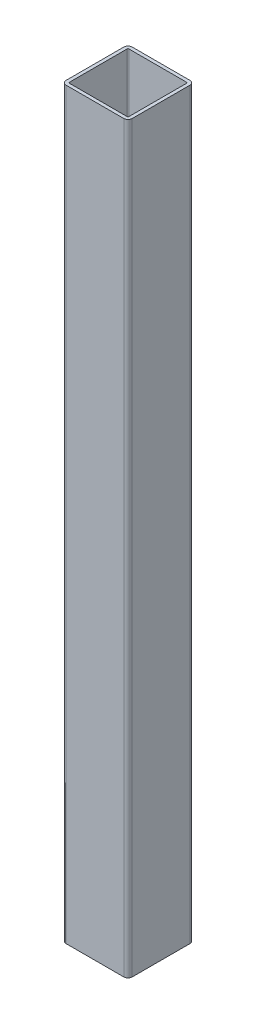
ISO-10303-21;
HEADER;
FILE_DESCRIPTION(('STEP AP214'),'2;1');
FILE_NAME('part.step','',(''),(''),'','','');
FILE_SCHEMA(('AUTOMOTIVE_DESIGN { 1 0 10303 214 1 1 1 1 }'));
ENDSEC;
DATA;
#1=APPLICATION_CONTEXT('core data for automotive mechanical design processes');
#2=APPLICATION_PROTOCOL_DEFINITION('international standard','automotive_design',2000,#1);
#3=PRODUCT_CONTEXT('',#1,'mechanical');
#4=PRODUCT('Part','Part','',(#3));
#5=PRODUCT_RELATED_PRODUCT_CATEGORY('part','',(#4));
#6=PRODUCT_DEFINITION_FORMATION('','',#4);
#7=PRODUCT_DEFINITION_CONTEXT('part definition',#1,'design');
#8=PRODUCT_DEFINITION('design','',#6,#7);
#9=PRODUCT_DEFINITION_SHAPE('','',#8);
#10=(LENGTH_UNIT() NAMED_UNIT(*) SI_UNIT(.MILLI.,.METRE.));
#11=(NAMED_UNIT(*) PLANE_ANGLE_UNIT() SI_UNIT($,.RADIAN.));
#12=(NAMED_UNIT(*) SI_UNIT($,.STERADIAN.) SOLID_ANGLE_UNIT());
#13=UNCERTAINTY_MEASURE_WITH_UNIT(LENGTH_MEASURE(1.E-05),#10,'distance_accuracy_value','');
#14=(GEOMETRIC_REPRESENTATION_CONTEXT(3) GLOBAL_UNCERTAINTY_ASSIGNED_CONTEXT((#13)) GLOBAL_UNIT_ASSIGNED_CONTEXT((#10,
#11,#12)) REPRESENTATION_CONTEXT('',''));
#15=CARTESIAN_POINT('',(0.,0.,0.));
#16=DIRECTION('',(0.,0.,1.));
#17=DIRECTION('',(1.,0.,0.));
#18=AXIS2_PLACEMENT_3D('',#15,#16,#17);
#19=CARTESIAN_POINT('',(-35.,900.000000000001,35.));
#20=DIRECTION('',(0.,1.,0.));
#21=DIRECTION('',(0.,0.,1.));
#22=AXIS2_PLACEMENT_3D('',#19,#20,#21);
#23=PLANE('',#22);
#24=CARTESIAN_POINT('',(-35.,900.000000000001,35.));
#25=DIRECTION('',(0.,1.,0.));
#26=DIRECTION('',(0.,0.,1.));
#27=AXIS2_PLACEMENT_3D('',#24,#25,#26);
#28=CIRCLE('',#27,5.);
#29=CARTESIAN_POINT('',(-40.,900.000000000001,35.));
#30=VERTEX_POINT('',#29);
#31=CARTESIAN_POINT('',(-35.,900.000000000001,40.));
#32=VERTEX_POINT('',#31);
#33=EDGE_CURVE('E260',#30,#32,#28,.T.);
#34=ORIENTED_EDGE('',*,*,#33,.T.);
#35=DIRECTION('',(1.,0.,0.));
#36=VECTOR('',#35,1.);
#37=CARTESIAN_POINT('',(-35.,900.000000000001,40.));
#38=LINE('',#37,#36);
#39=CARTESIAN_POINT('',(35.,900.000000000001,40.));
#40=VERTEX_POINT('',#39);
#41=EDGE_CURVE('E263',#32,#40,#38,.T.);
#42=ORIENTED_EDGE('',*,*,#41,.T.);
#43=CARTESIAN_POINT('',(35.,900.000000000001,35.));
#44=DIRECTION('',(0.,1.,0.));
#45=DIRECTION('',(0.,0.,1.));
#46=AXIS2_PLACEMENT_3D('',#43,#44,#45);
#47=CIRCLE('',#46,5.);
#48=CARTESIAN_POINT('',(40.,900.000000000001,35.));
#49=VERTEX_POINT('',#48);
#50=EDGE_CURVE('E266',#40,#49,#47,.T.);
#51=ORIENTED_EDGE('',*,*,#50,.T.);
#52=DIRECTION('',(0.,0.,-1.));
#53=VECTOR('',#52,1.);
#54=CARTESIAN_POINT('',(40.,900.000000000001,-35.));
#55=LINE('',#54,#53);
#56=CARTESIAN_POINT('',(40.,900.000000000001,-35.));
#57=VERTEX_POINT('',#56);
#58=EDGE_CURVE('E268',#49,#57,#55,.T.);
#59=ORIENTED_EDGE('',*,*,#58,.T.);
#60=CARTESIAN_POINT('',(35.,900.000000000001,-35.));
#61=DIRECTION('',(0.,1.,0.));
#62=DIRECTION('',(0.,0.,-1.));
#63=AXIS2_PLACEMENT_3D('',#60,#61,#62);
#64=CIRCLE('',#63,5.);
#65=CARTESIAN_POINT('',(35.,900.000000000001,-40.));
#66=VERTEX_POINT('',#65);
#67=EDGE_CURVE('E270',#57,#66,#64,.T.);
#68=ORIENTED_EDGE('',*,*,#67,.T.);
#69=DIRECTION('',(-1.,0.,0.));
#70=VECTOR('',#69,1.);
#71=CARTESIAN_POINT('',(-35.,900.000000000001,-40.));
#72=LINE('',#71,#70);
#73=CARTESIAN_POINT('',(-35.,900.000000000001,-40.));
#74=VERTEX_POINT('',#73);
#75=EDGE_CURVE('E272',#66,#74,#72,.T.);
#76=ORIENTED_EDGE('',*,*,#75,.T.);
#77=CARTESIAN_POINT('',(-35.,900.000000000001,-35.));
#78=DIRECTION('',(0.,1.,0.));
#79=DIRECTION('',(0.,0.,1.));
#80=AXIS2_PLACEMENT_3D('',#77,#78,#79);
#81=CIRCLE('',#80,5.);
#82=CARTESIAN_POINT('',(-40.,900.000000000001,-35.));
#83=VERTEX_POINT('',#82);
#84=EDGE_CURVE('E274',#74,#83,#81,.T.);
#85=ORIENTED_EDGE('',*,*,#84,.T.);
#86=DIRECTION('',(0.,0.,1.));
#87=VECTOR('',#86,1.);
#88=CARTESIAN_POINT('',(-40.,900.000000000001,-35.));
#89=LINE('',#88,#87);
#90=EDGE_CURVE('E276',#83,#30,#89,.T.);
#91=ORIENTED_EDGE('',*,*,#90,.T.);
#92=EDGE_LOOP('',(#34,#42,#51,#59,#68,#76,#85,#91));
#93=FACE_BOUND('',#92,.T.);
#94=DIRECTION('',(1.,0.,0.));
#95=VECTOR('',#94,1.);
#96=CARTESIAN_POINT('',(-35.,900.000000000001,36.));
#97=LINE('',#96,#95);
#98=CARTESIAN_POINT('',(-35.,900.000000000001,36.));
#99=VERTEX_POINT('',#98);
#100=CARTESIAN_POINT('',(35.,900.000000000001,36.));
#101=VERTEX_POINT('',#100);
#102=EDGE_CURVE('E203',#99,#101,#97,.T.);
#103=ORIENTED_EDGE('',*,*,#102,.F.);
#104=CARTESIAN_POINT('',(-35.,900.000000000001,35.));
#105=DIRECTION('',(0.,1.,0.));
#106=DIRECTION('',(1.,0.,0.));
#107=AXIS2_PLACEMENT_3D('',#104,#105,#106);
#108=CIRCLE('',#107,0.999999999999997);
#109=CARTESIAN_POINT('',(-36.,900.000000000001,35.));
#110=VERTEX_POINT('',#109);
#111=EDGE_CURVE('E195',#110,#99,#108,.T.);
#112=ORIENTED_EDGE('',*,*,#111,.F.);
#113=DIRECTION('',(0.,0.,1.));
#114=VECTOR('',#113,1.);
#115=CARTESIAN_POINT('',(-36.,900.000000000001,-35.));
#116=LINE('',#115,#114);
#117=CARTESIAN_POINT('',(-36.,900.000000000001,-35.));
#118=VERTEX_POINT('',#117);
#119=EDGE_CURVE('E228',#118,#110,#116,.T.);
#120=ORIENTED_EDGE('',*,*,#119,.F.);
#121=CARTESIAN_POINT('',(-35.,900.000000000001,-35.));
#122=DIRECTION('',(0.,1.,0.));
#123=DIRECTION('',(1.,0.,0.));
#124=AXIS2_PLACEMENT_3D('',#121,#122,#123);
#125=CIRCLE('',#124,0.999999999999997);
#126=CARTESIAN_POINT('',(-35.,900.000000000001,-36.));
#127=VERTEX_POINT('',#126);
#128=EDGE_CURVE('E226',#127,#118,#125,.T.);
#129=ORIENTED_EDGE('',*,*,#128,.F.);
#130=DIRECTION('',(-1.,0.,0.));
#131=VECTOR('',#130,1.);
#132=CARTESIAN_POINT('',(-35.,900.000000000001,-36.));
#133=LINE('',#132,#131);
#134=CARTESIAN_POINT('',(35.,900.000000000001,-36.));
#135=VERTEX_POINT('',#134);
#136=EDGE_CURVE('E224',#135,#127,#133,.T.);
#137=ORIENTED_EDGE('',*,*,#136,.F.);
#138=CARTESIAN_POINT('',(35.,900.000000000001,-35.));
#139=DIRECTION('',(0.,1.,0.));
#140=DIRECTION('',(1.,0.,0.));
#141=AXIS2_PLACEMENT_3D('',#138,#139,#140);
#142=CIRCLE('',#141,0.999999999999997);
#143=CARTESIAN_POINT('',(36.,900.000000000001,-35.));
#144=VERTEX_POINT('',#143);
#145=EDGE_CURVE('E222',#144,#135,#142,.T.);
#146=ORIENTED_EDGE('',*,*,#145,.F.);
#147=DIRECTION('',(0.,0.,-1.));
#148=VECTOR('',#147,1.);
#149=CARTESIAN_POINT('',(36.,900.000000000001,-35.));
#150=LINE('',#149,#148);
#151=CARTESIAN_POINT('',(36.,900.000000000001,35.));
#152=VERTEX_POINT('',#151);
#153=EDGE_CURVE('E218',#152,#144,#150,.T.);
#154=ORIENTED_EDGE('',*,*,#153,.F.);
#155=CARTESIAN_POINT('',(35.,900.000000000001,35.));
#156=DIRECTION('',(0.,1.,0.));
#157=DIRECTION('',(1.,0.,0.));
#158=AXIS2_PLACEMENT_3D('',#155,#156,#157);
#159=CIRCLE('',#158,0.999999999999997);
#160=EDGE_CURVE('E216',#101,#152,#159,.T.);
#161=ORIENTED_EDGE('',*,*,#160,.F.);
#162=EDGE_LOOP('',(#103,#112,#120,#129,#137,#146,#154,#161));
#163=FACE_BOUND('',#162,.T.);
#164=ADVANCED_FACE('F82',(#93,#163),#23,.T.);
#165=CARTESIAN_POINT('',(-35.,0.,35.));
#166=DIRECTION('',(0.,1.,0.));
#167=DIRECTION('',(0.,0.,1.));
#168=AXIS2_PLACEMENT_3D('',#165,#166,#167);
#169=PLANE('',#168);
#170=CARTESIAN_POINT('',(-35.,0.,35.));
#171=DIRECTION('',(0.,1.,0.));
#172=DIRECTION('',(0.,0.,1.));
#173=AXIS2_PLACEMENT_3D('',#170,#171,#172);
#174=CIRCLE('',#173,5.);
#175=CARTESIAN_POINT('',(-40.,0.,35.));
#176=VERTEX_POINT('',#175);
#177=CARTESIAN_POINT('',(-35.,0.,40.));
#178=VERTEX_POINT('',#177);
#179=EDGE_CURVE('E211',#176,#178,#174,.T.);
#180=ORIENTED_EDGE('',*,*,#179,.F.);
#181=DIRECTION('',(0.,0.,1.));
#182=VECTOR('',#181,1.);
#183=CARTESIAN_POINT('',(-40.,0.,-35.));
#184=LINE('',#183,#182);
#185=CARTESIAN_POINT('',(-40.,0.,-35.));
#186=VERTEX_POINT('',#185);
#187=EDGE_CURVE('E264',#186,#176,#184,.T.);
#188=ORIENTED_EDGE('',*,*,#187,.F.);
#189=CARTESIAN_POINT('',(-35.,0.,-35.));
#190=DIRECTION('',(0.,1.,0.));
#191=DIRECTION('',(0.,0.,1.));
#192=AXIS2_PLACEMENT_3D('',#189,#190,#191);
#193=CIRCLE('',#192,5.);
#194=CARTESIAN_POINT('',(-35.,0.,-40.));
#195=VERTEX_POINT('',#194);
#196=EDGE_CURVE('E291',#195,#186,#193,.T.);
#197=ORIENTED_EDGE('',*,*,#196,.F.);
#198=DIRECTION('',(-1.,0.,0.));
#199=VECTOR('',#198,1.);
#200=CARTESIAN_POINT('',(-35.,0.,-40.));
#201=LINE('',#200,#199);
#202=CARTESIAN_POINT('',(35.,0.,-40.));
#203=VERTEX_POINT('',#202);
#204=EDGE_CURVE('E289',#203,#195,#201,.T.);
#205=ORIENTED_EDGE('',*,*,#204,.F.);
#206=CARTESIAN_POINT('',(35.,0.,-35.));
#207=DIRECTION('',(0.,1.,0.));
#208=DIRECTION('',(0.,0.,-1.));
#209=AXIS2_PLACEMENT_3D('',#206,#207,#208);
#210=CIRCLE('',#209,5.);
#211=CARTESIAN_POINT('',(40.,0.,-35.));
#212=VERTEX_POINT('',#211);
#213=EDGE_CURVE('E287',#212,#203,#210,.T.);
#214=ORIENTED_EDGE('',*,*,#213,.F.);
#215=DIRECTION('',(0.,0.,-1.));
#216=VECTOR('',#215,1.);
#217=CARTESIAN_POINT('',(40.,0.,-35.));
#218=LINE('',#217,#216);
#219=CARTESIAN_POINT('',(40.,0.,35.));
#220=VERTEX_POINT('',#219);
#221=EDGE_CURVE('E285',#220,#212,#218,.T.);
#222=ORIENTED_EDGE('',*,*,#221,.F.);
#223=CARTESIAN_POINT('',(35.,0.,35.));
#224=DIRECTION('',(0.,1.,0.));
#225=DIRECTION('',(0.,0.,1.));
#226=AXIS2_PLACEMENT_3D('',#223,#224,#225);
#227=CIRCLE('',#226,5.);
#228=CARTESIAN_POINT('',(35.,0.,40.));
#229=VERTEX_POINT('',#228);
#230=EDGE_CURVE('E283',#229,#220,#227,.T.);
#231=ORIENTED_EDGE('',*,*,#230,.F.);
#232=DIRECTION('',(1.,0.,0.));
#233=VECTOR('',#232,1.);
#234=CARTESIAN_POINT('',(-35.,0.,40.));
#235=LINE('',#234,#233);
#236=EDGE_CURVE('E281',#178,#229,#235,.T.);
#237=ORIENTED_EDGE('',*,*,#236,.F.);
#238=EDGE_LOOP('',(#180,#188,#197,#205,#214,#222,#231,#237));
#239=FACE_BOUND('',#238,.T.);
#240=CARTESIAN_POINT('',(-35.,0.,35.));
#241=DIRECTION('',(0.,1.,0.));
#242=DIRECTION('',(1.,0.,0.));
#243=AXIS2_PLACEMENT_3D('',#240,#241,#242);
#244=CIRCLE('',#243,0.999999999999997);
#245=CARTESIAN_POINT('',(-36.,0.,35.));
#246=VERTEX_POINT('',#245);
#247=CARTESIAN_POINT('',(-35.,0.,36.));
#248=VERTEX_POINT('',#247);
#249=EDGE_CURVE('E105',#246,#248,#244,.T.);
#250=ORIENTED_EDGE('',*,*,#249,.T.);
#251=DIRECTION('',(1.,0.,0.));
#252=VECTOR('',#251,1.);
#253=CARTESIAN_POINT('',(-35.,0.,36.));
#254=LINE('',#253,#252);
#255=CARTESIAN_POINT('',(35.,0.,36.));
#256=VERTEX_POINT('',#255);
#257=EDGE_CURVE('E210',#248,#256,#254,.T.);
#258=ORIENTED_EDGE('',*,*,#257,.T.);
#259=CARTESIAN_POINT('',(35.,0.,35.));
#260=DIRECTION('',(0.,1.,0.));
#261=DIRECTION('',(1.,0.,0.));
#262=AXIS2_PLACEMENT_3D('',#259,#260,#261);
#263=CIRCLE('',#262,0.999999999999997);
#264=CARTESIAN_POINT('',(36.,0.,35.));
#265=VERTEX_POINT('',#264);
#266=EDGE_CURVE('E232',#256,#265,#263,.T.);
#267=ORIENTED_EDGE('',*,*,#266,.T.);
#268=DIRECTION('',(0.,0.,-1.));
#269=VECTOR('',#268,1.);
#270=CARTESIAN_POINT('',(36.,0.,-35.));
#271=LINE('',#270,#269);
#272=CARTESIAN_POINT('',(36.,0.,-35.));
#273=VERTEX_POINT('',#272);
#274=EDGE_CURVE('E235',#265,#273,#271,.T.);
#275=ORIENTED_EDGE('',*,*,#274,.T.);
#276=CARTESIAN_POINT('',(35.,0.,-35.));
#277=DIRECTION('',(0.,1.,0.));
#278=DIRECTION('',(1.,0.,0.));
#279=AXIS2_PLACEMENT_3D('',#276,#277,#278);
#280=CIRCLE('',#279,0.999999999999997);
#281=CARTESIAN_POINT('',(35.,0.,-36.));
#282=VERTEX_POINT('',#281);
#283=EDGE_CURVE('E238',#273,#282,#280,.T.);
#284=ORIENTED_EDGE('',*,*,#283,.T.);
#285=DIRECTION('',(-1.,0.,0.));
#286=VECTOR('',#285,1.);
#287=CARTESIAN_POINT('',(-35.,0.,-36.));
#288=LINE('',#287,#286);
#289=CARTESIAN_POINT('',(-35.,0.,-36.));
#290=VERTEX_POINT('',#289);
#291=EDGE_CURVE('E241',#282,#290,#288,.T.);
#292=ORIENTED_EDGE('',*,*,#291,.T.);
#293=CARTESIAN_POINT('',(-35.,0.,-35.));
#294=DIRECTION('',(0.,1.,0.));
#295=DIRECTION('',(1.,0.,0.));
#296=AXIS2_PLACEMENT_3D('',#293,#294,#295);
#297=CIRCLE('',#296,0.999999999999997);
#298=CARTESIAN_POINT('',(-36.,0.,-35.));
#299=VERTEX_POINT('',#298);
#300=EDGE_CURVE('E244',#290,#299,#297,.T.);
#301=ORIENTED_EDGE('',*,*,#300,.T.);
#302=DIRECTION('',(0.,0.,1.));
#303=VECTOR('',#302,1.);
#304=CARTESIAN_POINT('',(-36.,0.,-35.));
#305=LINE('',#304,#303);
#306=EDGE_CURVE('E204',#299,#246,#305,.T.);
#307=ORIENTED_EDGE('',*,*,#306,.T.);
#308=EDGE_LOOP('',(#250,#258,#267,#275,#284,#292,#301,#307));
#309=FACE_BOUND('',#308,.T.);
#310=ADVANCED_FACE('F321',(#239,#309),#169,.F.);
#311=CARTESIAN_POINT('',(-35.,900.000000000001,35.));
#312=DIRECTION('',(0.,-1.,0.));
#313=DIRECTION('',(0.,0.,-1.));
#314=AXIS2_PLACEMENT_3D('',#311,#312,#313);
#315=CYLINDRICAL_SURFACE('',#314,5.);
#316=ORIENTED_EDGE('',*,*,#179,.T.);
#317=DIRECTION('',(0.,-1.,0.));
#318=VECTOR('',#317,1.);
#319=CARTESIAN_POINT('',(-35.,900.000000000001,40.));
#320=LINE('',#319,#318);
#321=EDGE_CURVE('E12',#32,#178,#320,.T.);
#322=ORIENTED_EDGE('',*,*,#321,.F.);
#323=ORIENTED_EDGE('',*,*,#33,.F.);
#324=DIRECTION('',(0.,-1.,0.));
#325=VECTOR('',#324,1.);
#326=CARTESIAN_POINT('',(-40.,900.000000000001,35.));
#327=LINE('',#326,#325);
#328=EDGE_CURVE('E278',#30,#176,#327,.T.);
#329=ORIENTED_EDGE('',*,*,#328,.T.);
#330=EDGE_LOOP('',(#316,#322,#323,#329));
#331=FACE_BOUND('',#330,.T.);
#332=ADVANCED_FACE('F84',(#331),#315,.T.);
#333=CARTESIAN_POINT('',(-35.,900.000000000001,40.));
#334=DIRECTION('',(0.,0.,-1.));
#335=DIRECTION('',(-1.,0.,0.));
#336=AXIS2_PLACEMENT_3D('',#333,#334,#335);
#337=PLANE('',#336);
#338=ORIENTED_EDGE('',*,*,#236,.T.);
#339=DIRECTION('',(0.,-1.,0.));
#340=VECTOR('',#339,1.);
#341=CARTESIAN_POINT('',(35.,900.000000000001,40.));
#342=LINE('',#341,#340);
#343=EDGE_CURVE('E90',#40,#229,#342,.T.);
#344=ORIENTED_EDGE('',*,*,#343,.F.);
#345=ORIENTED_EDGE('',*,*,#41,.F.);
#346=ORIENTED_EDGE('',*,*,#321,.T.);
#347=EDGE_LOOP('',(#338,#344,#345,#346));
#348=FACE_BOUND('',#347,.T.);
#349=ADVANCED_FACE('F338',(#348),#337,.F.);
#350=CARTESIAN_POINT('',(35.,900.000000000001,35.));
#351=DIRECTION('',(0.,-1.,0.));
#352=DIRECTION('',(0.,0.,-1.));
#353=AXIS2_PLACEMENT_3D('',#350,#351,#352);
#354=CYLINDRICAL_SURFACE('',#353,5.);
#355=ORIENTED_EDGE('',*,*,#230,.T.);
#356=DIRECTION('',(0.,-1.,0.));
#357=VECTOR('',#356,1.);
#358=CARTESIAN_POINT('',(40.,900.000000000001,35.));
#359=LINE('',#358,#357);
#360=EDGE_CURVE('E308',#49,#220,#359,.T.);
#361=ORIENTED_EDGE('',*,*,#360,.F.);
#362=ORIENTED_EDGE('',*,*,#50,.F.);
#363=ORIENTED_EDGE('',*,*,#343,.T.);
#364=EDGE_LOOP('',(#355,#361,#362,#363));
#365=FACE_BOUND('',#364,.T.);
#366=ADVANCED_FACE('F315',(#365),#354,.T.);
#367=CARTESIAN_POINT('',(40.,900.000000000001,-35.));
#368=DIRECTION('',(-1.,0.,0.));
#369=DIRECTION('',(0.,0.,1.));
#370=AXIS2_PLACEMENT_3D('',#367,#368,#369);
#371=PLANE('',#370);
#372=ORIENTED_EDGE('',*,*,#221,.T.);
#373=DIRECTION('',(0.,-1.,0.));
#374=VECTOR('',#373,1.);
#375=CARTESIAN_POINT('',(40.,900.000000000001,-35.));
#376=LINE('',#375,#374);
#377=EDGE_CURVE('E305',#57,#212,#376,.T.);
#378=ORIENTED_EDGE('',*,*,#377,.F.);
#379=ORIENTED_EDGE('',*,*,#58,.F.);
#380=ORIENTED_EDGE('',*,*,#360,.T.);
#381=EDGE_LOOP('',(#372,#378,#379,#380));
#382=FACE_BOUND('',#381,.T.);
#383=ADVANCED_FACE('F327',(#382),#371,.F.);
#384=CARTESIAN_POINT('',(35.,900.000000000001,-35.));
#385=DIRECTION('',(0.,-1.,0.));
#386=DIRECTION('',(0.,0.,-1.));
#387=AXIS2_PLACEMENT_3D('',#384,#385,#386);
#388=CYLINDRICAL_SURFACE('',#387,5.);
#389=ORIENTED_EDGE('',*,*,#213,.T.);
#390=DIRECTION('',(0.,-1.,0.));
#391=VECTOR('',#390,1.);
#392=CARTESIAN_POINT('',(35.,900.000000000001,-40.));
#393=LINE('',#392,#391);
#394=EDGE_CURVE('E302',#66,#203,#393,.T.);
#395=ORIENTED_EDGE('',*,*,#394,.F.);
#396=ORIENTED_EDGE('',*,*,#67,.F.);
#397=ORIENTED_EDGE('',*,*,#377,.T.);
#398=EDGE_LOOP('',(#389,#395,#396,#397));
#399=FACE_BOUND('',#398,.T.);
#400=ADVANCED_FACE('F331',(#399),#388,.T.);
#401=CARTESIAN_POINT('',(-35.,900.000000000001,-40.));
#402=DIRECTION('',(0.,0.,1.));
#403=DIRECTION('',(1.,0.,0.));
#404=AXIS2_PLACEMENT_3D('',#401,#402,#403);
#405=PLANE('',#404);
#406=ORIENTED_EDGE('',*,*,#204,.T.);
#407=DIRECTION('',(0.,-1.,0.));
#408=VECTOR('',#407,1.);
#409=CARTESIAN_POINT('',(-35.,900.000000000001,-40.));
#410=LINE('',#409,#408);
#411=EDGE_CURVE('E299',#74,#195,#410,.T.);
#412=ORIENTED_EDGE('',*,*,#411,.F.);
#413=ORIENTED_EDGE('',*,*,#75,.F.);
#414=ORIENTED_EDGE('',*,*,#394,.T.);
#415=EDGE_LOOP('',(#406,#412,#413,#414));
#416=FACE_BOUND('',#415,.T.);
#417=ADVANCED_FACE('F351',(#416),#405,.F.);
#418=CARTESIAN_POINT('',(-35.,900.000000000001,-35.));
#419=DIRECTION('',(0.,-1.,0.));
#420=DIRECTION('',(0.,0.,-1.));
#421=AXIS2_PLACEMENT_3D('',#418,#419,#420);
#422=CYLINDRICAL_SURFACE('',#421,5.);
#423=ORIENTED_EDGE('',*,*,#196,.T.);
#424=DIRECTION('',(0.,-1.,0.));
#425=VECTOR('',#424,1.);
#426=CARTESIAN_POINT('',(-40.,900.000000000001,-35.));
#427=LINE('',#426,#425);
#428=EDGE_CURVE('E296',#83,#186,#427,.T.);
#429=ORIENTED_EDGE('',*,*,#428,.F.);
#430=ORIENTED_EDGE('',*,*,#84,.F.);
#431=ORIENTED_EDGE('',*,*,#411,.T.);
#432=EDGE_LOOP('',(#423,#429,#430,#431));
#433=FACE_BOUND('',#432,.T.);
#434=ADVANCED_FACE('F349',(#433),#422,.T.);
#435=CARTESIAN_POINT('',(-40.,900.000000000001,-35.));
#436=DIRECTION('',(1.,0.,0.));
#437=DIRECTION('',(0.,0.,-1.));
#438=AXIS2_PLACEMENT_3D('',#435,#436,#437);
#439=PLANE('',#438);
#440=ORIENTED_EDGE('',*,*,#187,.T.);
#441=ORIENTED_EDGE('',*,*,#328,.F.);
#442=ORIENTED_EDGE('',*,*,#90,.F.);
#443=ORIENTED_EDGE('',*,*,#428,.T.);
#444=EDGE_LOOP('',(#440,#441,#442,#443));
#445=FACE_BOUND('',#444,.T.);
#446=ADVANCED_FACE('F344',(#445),#439,.F.);
#447=CARTESIAN_POINT('',(-35.,900.000000000001,35.));
#448=DIRECTION('',(0.,-1.,0.));
#449=DIRECTION('',(0.,0.,-1.));
#450=AXIS2_PLACEMENT_3D('',#447,#448,#449);
#451=CYLINDRICAL_SURFACE('',#450,0.999999999999997);
#452=ORIENTED_EDGE('',*,*,#249,.F.);
#453=DIRECTION('',(0.,-1.,0.));
#454=VECTOR('',#453,1.);
#455=CARTESIAN_POINT('',(-36.,900.000000000001,35.));
#456=LINE('',#455,#454);
#457=EDGE_CURVE('E199',#110,#246,#456,.T.);
#458=ORIENTED_EDGE('',*,*,#457,.F.);
#459=ORIENTED_EDGE('',*,*,#111,.T.);
#460=DIRECTION('',(0.,-1.,0.));
#461=VECTOR('',#460,1.);
#462=CARTESIAN_POINT('',(-35.,900.000000000001,36.));
#463=LINE('',#462,#461);
#464=EDGE_CURVE('E198',#99,#248,#463,.T.);
#465=ORIENTED_EDGE('',*,*,#464,.T.);
#466=EDGE_LOOP('',(#452,#458,#459,#465));
#467=FACE_BOUND('',#466,.T.);
#468=ADVANCED_FACE('F197',(#467),#451,.F.);
#469=CARTESIAN_POINT('',(-35.,900.000000000001,36.));
#470=DIRECTION('',(0.,0.,-1.));
#471=DIRECTION('',(-1.,0.,0.));
#472=AXIS2_PLACEMENT_3D('',#469,#470,#471);
#473=PLANE('',#472);
#474=ORIENTED_EDGE('',*,*,#257,.F.);
#475=ORIENTED_EDGE('',*,*,#464,.F.);
#476=ORIENTED_EDGE('',*,*,#102,.T.);
#477=DIRECTION('',(0.,-1.,0.));
#478=VECTOR('',#477,1.);
#479=CARTESIAN_POINT('',(35.,900.000000000001,36.));
#480=LINE('',#479,#478);
#481=EDGE_CURVE('E212',#101,#256,#480,.T.);
#482=ORIENTED_EDGE('',*,*,#481,.T.);
#483=EDGE_LOOP('',(#474,#475,#476,#482));
#484=FACE_BOUND('',#483,.T.);
#485=ADVANCED_FACE('F207',(#484),#473,.T.);
#486=CARTESIAN_POINT('',(35.,900.000000000001,35.));
#487=DIRECTION('',(0.,-1.,0.));
#488=DIRECTION('',(0.,0.,-1.));
#489=AXIS2_PLACEMENT_3D('',#486,#487,#488);
#490=CYLINDRICAL_SURFACE('',#489,0.999999999999997);
#491=ORIENTED_EDGE('',*,*,#266,.F.);
#492=ORIENTED_EDGE('',*,*,#481,.F.);
#493=ORIENTED_EDGE('',*,*,#160,.T.);
#494=DIRECTION('',(0.,-1.,0.));
#495=VECTOR('',#494,1.);
#496=CARTESIAN_POINT('',(36.,900.000000000001,35.));
#497=LINE('',#496,#495);
#498=EDGE_CURVE('E257',#152,#265,#497,.T.);
#499=ORIENTED_EDGE('',*,*,#498,.T.);
#500=EDGE_LOOP('',(#491,#492,#493,#499));
#501=FACE_BOUND('',#500,.T.);
#502=ADVANCED_FACE('F376',(#501),#490,.F.);
#503=CARTESIAN_POINT('',(36.,900.000000000001,-35.));
#504=DIRECTION('',(-1.,0.,0.));
#505=DIRECTION('',(0.,0.,1.));
#506=AXIS2_PLACEMENT_3D('',#503,#504,#505);
#507=PLANE('',#506);
#508=ORIENTED_EDGE('',*,*,#274,.F.);
#509=ORIENTED_EDGE('',*,*,#498,.F.);
#510=ORIENTED_EDGE('',*,*,#153,.T.);
#511=DIRECTION('',(0.,-1.,0.));
#512=VECTOR('',#511,1.);
#513=CARTESIAN_POINT('',(36.,900.000000000001,-35.));
#514=LINE('',#513,#512);
#515=EDGE_CURVE('E255',#144,#273,#514,.T.);
#516=ORIENTED_EDGE('',*,*,#515,.T.);
#517=EDGE_LOOP('',(#508,#509,#510,#516));
#518=FACE_BOUND('',#517,.T.);
#519=ADVANCED_FACE('F380',(#518),#507,.T.);
#520=CARTESIAN_POINT('',(35.,900.000000000001,-35.));
#521=DIRECTION('',(0.,-1.,0.));
#522=DIRECTION('',(0.,0.,-1.));
#523=AXIS2_PLACEMENT_3D('',#520,#521,#522);
#524=CYLINDRICAL_SURFACE('',#523,0.999999999999997);
#525=ORIENTED_EDGE('',*,*,#283,.F.);
#526=ORIENTED_EDGE('',*,*,#515,.F.);
#527=ORIENTED_EDGE('',*,*,#145,.T.);
#528=DIRECTION('',(0.,-1.,0.));
#529=VECTOR('',#528,1.);
#530=CARTESIAN_POINT('',(35.,900.000000000001,-36.));
#531=LINE('',#530,#529);
#532=EDGE_CURVE('E253',#135,#282,#531,.T.);
#533=ORIENTED_EDGE('',*,*,#532,.T.);
#534=EDGE_LOOP('',(#525,#526,#527,#533));
#535=FACE_BOUND('',#534,.T.);
#536=ADVANCED_FACE('F386',(#535),#524,.F.);
#537=CARTESIAN_POINT('',(-35.,900.000000000001,-36.));
#538=DIRECTION('',(0.,0.,1.));
#539=DIRECTION('',(1.,0.,0.));
#540=AXIS2_PLACEMENT_3D('',#537,#538,#539);
#541=PLANE('',#540);
#542=ORIENTED_EDGE('',*,*,#291,.F.);
#543=ORIENTED_EDGE('',*,*,#532,.F.);
#544=ORIENTED_EDGE('',*,*,#136,.T.);
#545=DIRECTION('',(0.,-1.,0.));
#546=VECTOR('',#545,1.);
#547=CARTESIAN_POINT('',(-35.,900.000000000001,-36.));
#548=LINE('',#547,#546);
#549=EDGE_CURVE('E251',#127,#290,#548,.T.);
#550=ORIENTED_EDGE('',*,*,#549,.T.);
#551=EDGE_LOOP('',(#542,#543,#544,#550));
#552=FACE_BOUND('',#551,.T.);
#553=ADVANCED_FACE('F390',(#552),#541,.T.);
#554=CARTESIAN_POINT('',(-35.,900.000000000001,-35.));
#555=DIRECTION('',(0.,-1.,0.));
#556=DIRECTION('',(0.,0.,-1.));
#557=AXIS2_PLACEMENT_3D('',#554,#555,#556);
#558=CYLINDRICAL_SURFACE('',#557,0.999999999999997);
#559=ORIENTED_EDGE('',*,*,#300,.F.);
#560=ORIENTED_EDGE('',*,*,#549,.F.);
#561=ORIENTED_EDGE('',*,*,#128,.T.);
#562=DIRECTION('',(0.,-1.,0.));
#563=VECTOR('',#562,1.);
#564=CARTESIAN_POINT('',(-36.,900.000000000001,-35.));
#565=LINE('',#564,#563);
#566=EDGE_CURVE('E97',#118,#299,#565,.T.);
#567=ORIENTED_EDGE('',*,*,#566,.T.);
#568=EDGE_LOOP('',(#559,#560,#561,#567));
#569=FACE_BOUND('',#568,.T.);
#570=ADVANCED_FACE('F394',(#569),#558,.F.);
#571=CARTESIAN_POINT('',(-36.,900.000000000001,-35.));
#572=DIRECTION('',(1.,0.,0.));
#573=DIRECTION('',(0.,0.,-1.));
#574=AXIS2_PLACEMENT_3D('',#571,#572,#573);
#575=PLANE('',#574);
#576=ORIENTED_EDGE('',*,*,#306,.F.);
#577=ORIENTED_EDGE('',*,*,#566,.F.);
#578=ORIENTED_EDGE('',*,*,#119,.T.);
#579=ORIENTED_EDGE('',*,*,#457,.T.);
#580=EDGE_LOOP('',(#576,#577,#578,#579));
#581=FACE_BOUND('',#580,.T.);
#582=ADVANCED_FACE('F398',(#581),#575,.T.);
#583=CLOSED_SHELL('',(#164,#310,#332,#349,#366,#383,#400,#417,#434,#446,#468,#485,#502,#519,
#536,#553,#570,#582));
#584=MANIFOLD_SOLID_BREP('B2',#583);
#585=ADVANCED_BREP_SHAPE_REPRESENTATION('',(#18,#584),#14);
#586=SHAPE_DEFINITION_REPRESENTATION(#9,#585);
ENDSEC;
END-ISO-10303-21;
